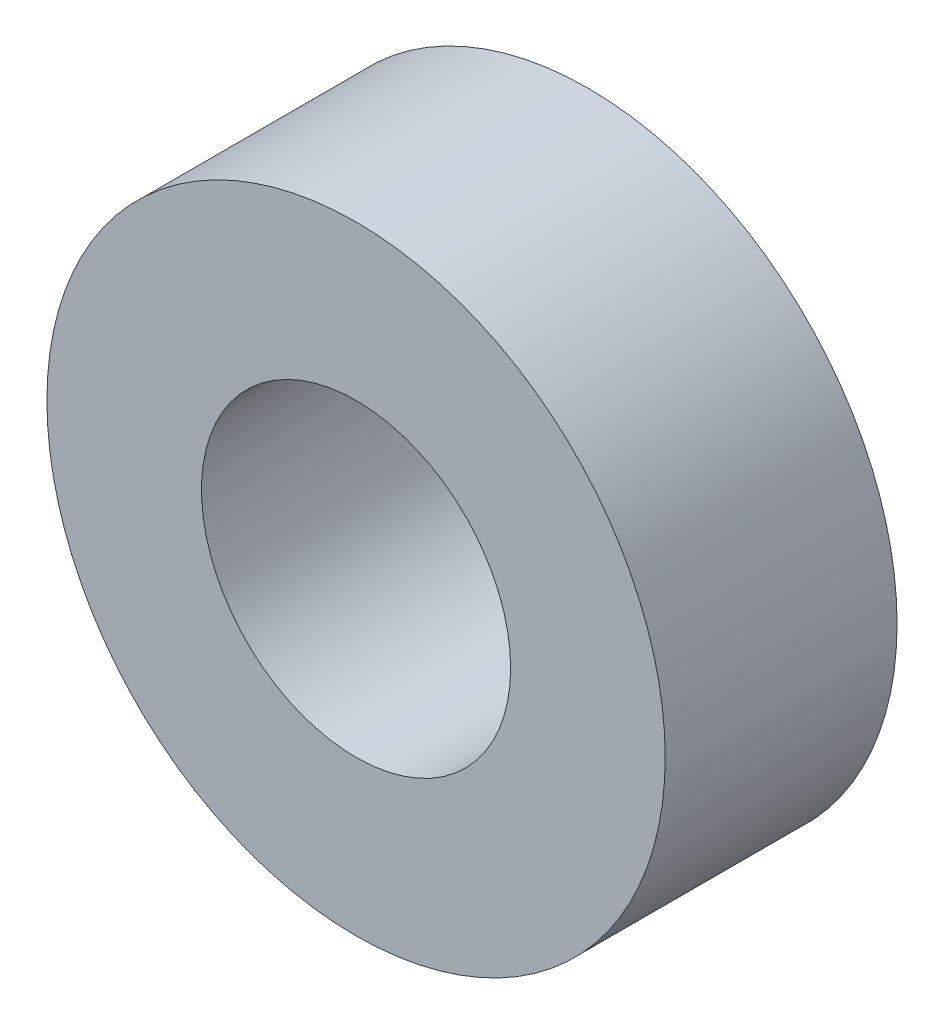
ISO-10303-21;
HEADER;
FILE_DESCRIPTION(('STEP AP214'),'2;1');
FILE_NAME('part.step','',(''),(''),'','','');
FILE_SCHEMA(('AUTOMOTIVE_DESIGN { 1 0 10303 214 1 1 1 1 }'));
ENDSEC;
DATA;
#1=APPLICATION_CONTEXT('core data for automotive mechanical design processes');
#2=APPLICATION_PROTOCOL_DEFINITION('international standard','automotive_design',2000,#1);
#3=PRODUCT_CONTEXT('',#1,'mechanical');
#4=PRODUCT('Part','Part','',(#3));
#5=PRODUCT_RELATED_PRODUCT_CATEGORY('part','',(#4));
#6=PRODUCT_DEFINITION_FORMATION('','',#4);
#7=PRODUCT_DEFINITION_CONTEXT('part definition',#1,'design');
#8=PRODUCT_DEFINITION('design','',#6,#7);
#9=PRODUCT_DEFINITION_SHAPE('','',#8);
#10=(LENGTH_UNIT() NAMED_UNIT(*) SI_UNIT(.MILLI.,.METRE.));
#11=(NAMED_UNIT(*) PLANE_ANGLE_UNIT() SI_UNIT($,.RADIAN.));
#12=(NAMED_UNIT(*) SI_UNIT($,.STERADIAN.) SOLID_ANGLE_UNIT());
#13=UNCERTAINTY_MEASURE_WITH_UNIT(LENGTH_MEASURE(1.E-05),#10,'distance_accuracy_value','');
#14=(GEOMETRIC_REPRESENTATION_CONTEXT(3) GLOBAL_UNCERTAINTY_ASSIGNED_CONTEXT((#13)) GLOBAL_UNIT_ASSIGNED_CONTEXT((#10,
#11,#12)) REPRESENTATION_CONTEXT('',''));
#15=CARTESIAN_POINT('',(0.,0.,0.));
#16=DIRECTION('',(0.,0.,1.));
#17=DIRECTION('',(1.,0.,0.));
#18=AXIS2_PLACEMENT_3D('',#15,#16,#17);
#19=CARTESIAN_POINT('',(0.,0.,3.));
#20=DIRECTION('',(0.,0.,1.));
#21=DIRECTION('',(1.,0.,0.));
#22=AXIS2_PLACEMENT_3D('',#19,#20,#21);
#23=PLANE('',#22);
#24=CARTESIAN_POINT('',(0.,0.,3.));
#25=DIRECTION('',(0.,0.,1.));
#26=DIRECTION('',(1.,0.,0.));
#27=AXIS2_PLACEMENT_3D('',#24,#25,#26);
#28=CIRCLE('',#27,4.);
#29=CARTESIAN_POINT('',(4.,0.,3.));
#30=VERTEX_POINT('',#29);
#31=EDGE_CURVE('E10',#30,#30,#28,.T.);
#32=ORIENTED_EDGE('',*,*,#31,.T.);
#33=EDGE_LOOP('',(#32));
#34=FACE_BOUND('',#33,.T.);
#35=CARTESIAN_POINT('',(0.,0.,3.));
#36=DIRECTION('',(0.,0.,1.));
#37=DIRECTION('',(1.,0.,0.));
#38=AXIS2_PLACEMENT_3D('',#35,#36,#37);
#39=CIRCLE('',#38,2.);
#40=CARTESIAN_POINT('',(2.,0.,3.));
#41=VERTEX_POINT('',#40);
#42=EDGE_CURVE('E44',#41,#41,#39,.T.);
#43=ORIENTED_EDGE('',*,*,#42,.F.);
#44=EDGE_LOOP('',(#43));
#45=FACE_BOUND('',#44,.T.);
#46=ADVANCED_FACE('F33',(#34,#45),#23,.T.);
#47=CARTESIAN_POINT('',(0.,0.,0.));
#48=DIRECTION('',(0.,0.,1.));
#49=DIRECTION('',(1.,0.,0.));
#50=AXIS2_PLACEMENT_3D('',#47,#48,#49);
#51=PLANE('',#50);
#52=CARTESIAN_POINT('',(0.,0.,0.));
#53=DIRECTION('',(0.,0.,1.));
#54=DIRECTION('',(1.,0.,0.));
#55=AXIS2_PLACEMENT_3D('',#52,#53,#54);
#56=CIRCLE('',#55,4.);
#57=CARTESIAN_POINT('',(4.,0.,0.));
#58=VERTEX_POINT('',#57);
#59=EDGE_CURVE('E37',#58,#58,#56,.T.);
#60=ORIENTED_EDGE('',*,*,#59,.F.);
#61=EDGE_LOOP('',(#60));
#62=FACE_BOUND('',#61,.T.);
#63=CARTESIAN_POINT('',(0.,0.,0.));
#64=DIRECTION('',(0.,0.,1.));
#65=DIRECTION('',(1.,0.,0.));
#66=AXIS2_PLACEMENT_3D('',#63,#64,#65);
#67=CIRCLE('',#66,2.);
#68=CARTESIAN_POINT('',(2.,0.,0.));
#69=VERTEX_POINT('',#68);
#70=EDGE_CURVE('E46',#69,#69,#67,.T.);
#71=ORIENTED_EDGE('',*,*,#70,.T.);
#72=EDGE_LOOP('',(#71));
#73=FACE_BOUND('',#72,.T.);
#74=ADVANCED_FACE('F56',(#62,#73),#51,.F.);
#75=CARTESIAN_POINT('',(0.,0.,3.));
#76=DIRECTION('',(0.,0.,-1.));
#77=DIRECTION('',(-1.,0.,0.));
#78=AXIS2_PLACEMENT_3D('',#75,#76,#77);
#79=CYLINDRICAL_SURFACE('',#78,4.);
#80=ORIENTED_EDGE('',*,*,#31,.F.);
#81=EDGE_LOOP('',(#80));
#82=FACE_BOUND('',#81,.T.);
#83=ORIENTED_EDGE('',*,*,#59,.T.);
#84=EDGE_LOOP('',(#83));
#85=FACE_BOUND('',#84,.T.);
#86=ADVANCED_FACE('F35',(#82,#85),#79,.T.);
#87=CARTESIAN_POINT('',(0.,0.,3.));
#88=DIRECTION('',(0.,0.,-1.));
#89=DIRECTION('',(-1.,0.,0.));
#90=AXIS2_PLACEMENT_3D('',#87,#88,#89);
#91=CYLINDRICAL_SURFACE('',#90,2.);
#92=ORIENTED_EDGE('',*,*,#42,.T.);
#93=EDGE_LOOP('',(#92));
#94=FACE_BOUND('',#93,.T.);
#95=ORIENTED_EDGE('',*,*,#70,.F.);
#96=EDGE_LOOP('',(#95));
#97=FACE_BOUND('',#96,.T.);
#98=ADVANCED_FACE('F52',(#94,#97),#91,.F.);
#99=CLOSED_SHELL('',(#46,#74,#86,#98));
#100=MANIFOLD_SOLID_BREP('B2',#99);
#101=ADVANCED_BREP_SHAPE_REPRESENTATION('',(#18,#100),#14);
#102=SHAPE_DEFINITION_REPRESENTATION(#9,#101);
ENDSEC;
END-ISO-10303-21;
